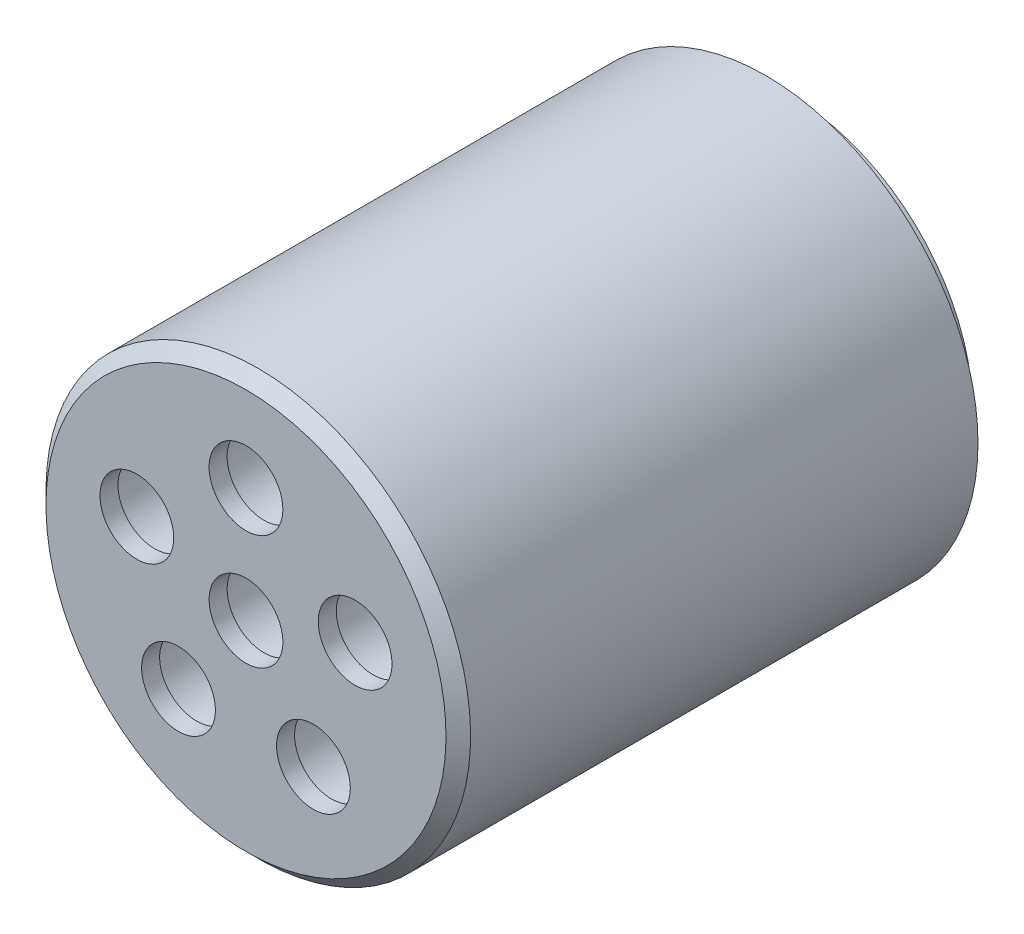
ISO-10303-21;
HEADER;
FILE_DESCRIPTION(('STEP AP214'),'2;1');
FILE_NAME('part.step','',(''),(''),'','','');
FILE_SCHEMA(('AUTOMOTIVE_DESIGN { 1 0 10303 214 1 1 1 1 }'));
ENDSEC;
DATA;
#1=APPLICATION_CONTEXT('core data for automotive mechanical design processes');
#2=APPLICATION_PROTOCOL_DEFINITION('international standard','automotive_design',2000,#1);
#3=PRODUCT_CONTEXT('',#1,'mechanical');
#4=PRODUCT('Part','Part','',(#3));
#5=PRODUCT_RELATED_PRODUCT_CATEGORY('part','',(#4));
#6=PRODUCT_DEFINITION_FORMATION('','',#4);
#7=PRODUCT_DEFINITION_CONTEXT('part definition',#1,'design');
#8=PRODUCT_DEFINITION('design','',#6,#7);
#9=PRODUCT_DEFINITION_SHAPE('','',#8);
#10=(LENGTH_UNIT() NAMED_UNIT(*) SI_UNIT(.MILLI.,.METRE.));
#11=(NAMED_UNIT(*) PLANE_ANGLE_UNIT() SI_UNIT($,.RADIAN.));
#12=(NAMED_UNIT(*) SI_UNIT($,.STERADIAN.) SOLID_ANGLE_UNIT());
#13=UNCERTAINTY_MEASURE_WITH_UNIT(LENGTH_MEASURE(1.E-05),#10,'distance_accuracy_value','');
#14=(GEOMETRIC_REPRESENTATION_CONTEXT(3) GLOBAL_UNCERTAINTY_ASSIGNED_CONTEXT((#13)) GLOBAL_UNIT_ASSIGNED_CONTEXT((#10,
#11,#12)) REPRESENTATION_CONTEXT('',''));
#15=CARTESIAN_POINT('',(0.,0.,0.));
#16=DIRECTION('',(0.,0.,1.));
#17=DIRECTION('',(1.,0.,0.));
#18=AXIS2_PLACEMENT_3D('',#15,#16,#17);
#19=CARTESIAN_POINT('',(3.38195697194555,1.09886443199731,11.7983020948289));
#20=DIRECTION('',(0.,0.,1.));
#21=DIRECTION('',(0.,-1.,0.));
#22=AXIS2_PLACEMENT_3D('',#19,#20,#21);
#23=CYLINDRICAL_SURFACE('',#22,1.5113);
#24=CARTESIAN_POINT('',(3.38195697194555,1.09886443199731,19.9644044732656));
#25=DIRECTION('',(0.,0.,1.));
#26=DIRECTION('',(0.,-1.,0.));
#27=AXIS2_PLACEMENT_3D('',#24,#25,#26);
#28=CIRCLE('',#27,1.5113);
#29=CARTESIAN_POINT('',(3.38195697194555,-0.412435568002688,19.9644044732656));
#30=VERTEX_POINT('',#29);
#31=EDGE_CURVE('E19',#30,#30,#28,.T.);
#32=ORIENTED_EDGE('',*,*,#31,.T.);
#33=EDGE_LOOP('',(#32));
#34=FACE_BOUND('',#33,.T.);
#35=CARTESIAN_POINT('',(3.38195697194555,1.09886443199731,3.63219875470677));
#36=DIRECTION('',(0.,-8.75136113852796E-07,-0.999999999999617));
#37=DIRECTION('',(0.,0.999999999999617,-8.75136113852796E-07));
#38=AXIS2_PLACEMENT_3D('',#35,#36,#37);
#39=CIRCLE('',#38,1.5113);
#40=CARTESIAN_POINT('',(3.38195697194555,2.61016443199673,3.63219743211356));
#41=VERTEX_POINT('',#40);
#42=EDGE_CURVE('E83',#41,#41,#39,.F.);
#43=ORIENTED_EDGE('',*,*,#42,.F.);
#44=EDGE_LOOP('',(#43));
#45=FACE_BOUND('',#44,.T.);
#46=ADVANCED_FACE('F16',(#34,#45),#23,.F.);
#47=CARTESIAN_POINT('',(2.09016435715203,-2.87686443199732,11.7983020948289));
#48=DIRECTION('',(0.,0.,1.));
#49=DIRECTION('',(1.,0.,0.));
#50=AXIS2_PLACEMENT_3D('',#47,#48,#49);
#51=CYLINDRICAL_SURFACE('',#50,1.5113);
#52=CARTESIAN_POINT('',(2.09016435715203,-2.87686443199732,19.9644044732656));
#53=DIRECTION('',(0.,0.,1.));
#54=DIRECTION('',(1.,0.,0.));
#55=AXIS2_PLACEMENT_3D('',#52,#53,#54);
#56=CIRCLE('',#55,1.5113);
#57=CARTESIAN_POINT('',(3.60146435715203,-2.87686443199732,19.9644044732656));
#58=VERTEX_POINT('',#57);
#59=EDGE_CURVE('E97',#58,#58,#56,.T.);
#60=ORIENTED_EDGE('',*,*,#59,.T.);
#61=EDGE_LOOP('',(#60));
#62=FACE_BOUND('',#61,.T.);
#63=CARTESIAN_POINT('',(2.09016435715203,-2.87686443199732,3.63220223401068));
#64=DIRECTION('',(0.,-8.75136113852796E-07,-0.999999999999617));
#65=DIRECTION('',(0.,0.999999999999617,-8.75136113852796E-07));
#66=AXIS2_PLACEMENT_3D('',#63,#64,#65);
#67=CIRCLE('',#66,1.5113);
#68=CARTESIAN_POINT('',(2.09016435715203,-1.3655644319979,3.63220091141747));
#69=VERTEX_POINT('',#68);
#70=EDGE_CURVE('E80',#69,#69,#67,.F.);
#71=ORIENTED_EDGE('',*,*,#70,.F.);
#72=EDGE_LOOP('',(#71));
#73=FACE_BOUND('',#72,.T.);
#74=ADVANCED_FACE('F196',(#62,#73),#51,.F.);
#75=CARTESIAN_POINT('',(-2.09016435715203,-2.87686443199732,11.7983020948289));
#76=DIRECTION('',(0.,0.,1.));
#77=DIRECTION('',(1.,0.,0.));
#78=AXIS2_PLACEMENT_3D('',#75,#76,#77);
#79=CYLINDRICAL_SURFACE('',#78,1.5113);
#80=CARTESIAN_POINT('',(-2.09016435715203,-2.87686443199732,19.9644044732656));
#81=DIRECTION('',(0.,0.,1.));
#82=DIRECTION('',(1.,0.,0.));
#83=AXIS2_PLACEMENT_3D('',#80,#81,#82);
#84=CIRCLE('',#83,1.5113);
#85=CARTESIAN_POINT('',(-0.578864357152034,-2.87686443199732,19.9644044732656));
#86=VERTEX_POINT('',#85);
#87=EDGE_CURVE('E95',#86,#86,#84,.T.);
#88=ORIENTED_EDGE('',*,*,#87,.T.);
#89=EDGE_LOOP('',(#88));
#90=FACE_BOUND('',#89,.T.);
#91=CARTESIAN_POINT('',(-2.09016435715203,-2.87686443199732,3.63220223401068));
#92=DIRECTION('',(0.,-8.75136113852796E-07,-0.999999999999617));
#93=DIRECTION('',(0.,0.999999999999617,-8.75136113852796E-07));
#94=AXIS2_PLACEMENT_3D('',#91,#92,#93);
#95=CIRCLE('',#94,1.5113);
#96=CARTESIAN_POINT('',(-2.09016435715203,-1.3655644319979,3.63220091141747));
#97=VERTEX_POINT('',#96);
#98=EDGE_CURVE('E77',#97,#97,#95,.F.);
#99=ORIENTED_EDGE('',*,*,#98,.F.);
#100=EDGE_LOOP('',(#99));
#101=FACE_BOUND('',#100,.T.);
#102=ADVANCED_FACE('F192',(#90,#101),#79,.F.);
#103=CARTESIAN_POINT('',(-3.38195697194555,1.09886443199731,11.7983020948289));
#104=DIRECTION('',(0.,0.,1.));
#105=DIRECTION('',(0.,-1.,0.));
#106=AXIS2_PLACEMENT_3D('',#103,#104,#105);
#107=CYLINDRICAL_SURFACE('',#106,1.5113);
#108=CARTESIAN_POINT('',(-3.38195697194555,1.09886443199731,19.9644044732656));
#109=DIRECTION('',(0.,0.,1.));
#110=DIRECTION('',(0.,-1.,0.));
#111=AXIS2_PLACEMENT_3D('',#108,#109,#110);
#112=CIRCLE('',#111,1.5113);
#113=CARTESIAN_POINT('',(-3.38195697194555,-0.412435568002688,19.9644044732656));
#114=VERTEX_POINT('',#113);
#115=EDGE_CURVE('E92',#114,#114,#112,.T.);
#116=ORIENTED_EDGE('',*,*,#115,.T.);
#117=EDGE_LOOP('',(#116));
#118=FACE_BOUND('',#117,.T.);
#119=CARTESIAN_POINT('',(-3.38195697194555,1.09886443199731,3.63219875470677));
#120=DIRECTION('',(0.,-8.75136113852796E-07,-0.999999999999617));
#121=DIRECTION('',(0.,0.999999999999617,-8.75136113852796E-07));
#122=AXIS2_PLACEMENT_3D('',#119,#120,#121);
#123=CIRCLE('',#122,1.5113);
#124=CARTESIAN_POINT('',(-3.38195697194555,2.61016443199673,3.63219743211356));
#125=VERTEX_POINT('',#124);
#126=EDGE_CURVE('E74',#125,#125,#123,.F.);
#127=ORIENTED_EDGE('',*,*,#126,.F.);
#128=EDGE_LOOP('',(#127));
#129=FACE_BOUND('',#128,.T.);
#130=ADVANCED_FACE('F195',(#118,#129),#107,.F.);
#131=CARTESIAN_POINT('',(0.,3.556,11.7983020948289));
#132=DIRECTION('',(0.,0.,1.));
#133=DIRECTION('',(1.,0.,0.));
#134=AXIS2_PLACEMENT_3D('',#131,#132,#133);
#135=CYLINDRICAL_SURFACE('',#134,1.5113);
#136=CARTESIAN_POINT('',(0.,3.556,19.9644044732656));
#137=DIRECTION('',(0.,0.,1.));
#138=DIRECTION('',(1.,0.,0.));
#139=AXIS2_PLACEMENT_3D('',#136,#137,#138);
#140=CIRCLE('',#139,1.5113);
#141=CARTESIAN_POINT('',(1.5113,3.556,19.9644044732656));
#142=VERTEX_POINT('',#141);
#143=EDGE_CURVE('E89',#142,#142,#140,.T.);
#144=ORIENTED_EDGE('',*,*,#143,.T.);
#145=EDGE_LOOP('',(#144));
#146=FACE_BOUND('',#145,.T.);
#147=CARTESIAN_POINT('',(0.,3.556,3.6321966043787));
#148=DIRECTION('',(0.,-8.75136113852796E-07,-0.999999999999617));
#149=DIRECTION('',(0.,0.999999999999617,-8.75136113852796E-07));
#150=AXIS2_PLACEMENT_3D('',#147,#148,#149);
#151=CIRCLE('',#150,1.5113);
#152=CARTESIAN_POINT('',(0.,5.06729999999942,3.63219528178549));
#153=VERTEX_POINT('',#152);
#154=EDGE_CURVE('E71',#153,#153,#151,.F.);
#155=ORIENTED_EDGE('',*,*,#154,.F.);
#156=EDGE_LOOP('',(#155));
#157=FACE_BOUND('',#156,.T.);
#158=ADVANCED_FACE('F120',(#146,#157),#135,.F.);
#159=CARTESIAN_POINT('',(0.,0.,11.7983020948289));
#160=DIRECTION('',(0.,0.,-1.));
#161=DIRECTION('',(-1.,0.,0.));
#162=AXIS2_PLACEMENT_3D('',#159,#160,#161);
#163=CYLINDRICAL_SURFACE('',#162,1.5113);
#164=CARTESIAN_POINT('',(0.,0.,3.63219971636272));
#165=DIRECTION('',(0.,-8.75136113852796E-07,-0.999999999999617));
#166=DIRECTION('',(0.,0.999999999999617,-8.75136113852796E-07));
#167=AXIS2_PLACEMENT_3D('',#164,#165,#166);
#168=CIRCLE('',#167,1.5113);
#169=CARTESIAN_POINT('',(0.,1.51129999999942,3.63219839376951));
#170=VERTEX_POINT('',#169);
#171=EDGE_CURVE('E68',#170,#170,#168,.F.);
#172=ORIENTED_EDGE('',*,*,#171,.F.);
#173=EDGE_LOOP('',(#172));
#174=FACE_BOUND('',#173,.T.);
#175=CARTESIAN_POINT('',(0.,0.,19.9644044732656));
#176=DIRECTION('',(0.,0.,-1.));
#177=DIRECTION('',(-1.,0.,0.));
#178=AXIS2_PLACEMENT_3D('',#175,#176,#177);
#179=CIRCLE('',#178,1.5113);
#180=CARTESIAN_POINT('',(-1.5113,0.,19.9644044732656));
#181=VERTEX_POINT('',#180);
#182=EDGE_CURVE('E86',#181,#181,#179,.F.);
#183=ORIENTED_EDGE('',*,*,#182,.T.);
#184=EDGE_LOOP('',(#183));
#185=FACE_BOUND('',#184,.T.);
#186=ADVANCED_FACE('F109',(#174,#185),#163,.F.);
#187=CARTESIAN_POINT('',(2.29489983891079,0.74565815854384,19.9644044732656));
#188=DIRECTION('',(0.,0.,1.));
#189=DIRECTION('',(0.,-1.,0.));
#190=AXIS2_PLACEMENT_3D('',#187,#188,#189);
#191=PLANE('',#190);
#192=CARTESIAN_POINT('',(3.38195697194555,1.09886443199731,19.9644044732656));
#193=DIRECTION('',(0.,0.,1.));
#194=DIRECTION('',(0.,-1.,0.));
#195=AXIS2_PLACEMENT_3D('',#192,#193,#194);
#196=CIRCLE('',#195,1.14299975548785);
#197=CARTESIAN_POINT('',(3.38195697194555,-0.0441353234905354,19.9644044732656));
#198=VERTEX_POINT('',#197);
#199=EDGE_CURVE('E65',#198,#198,#196,.T.);
#200=ORIENTED_EDGE('',*,*,#199,.T.);
#201=EDGE_LOOP('',(#200));
#202=FACE_BOUND('',#201,.T.);
#203=ORIENTED_EDGE('',*,*,#31,.F.);
#204=EDGE_LOOP('',(#203));
#205=FACE_BOUND('',#204,.T.);
#206=ADVANCED_FACE('F106',(#202,#205),#191,.F.);
#207=CARTESIAN_POINT('',(1.41832610122353,-1.95215840305643,19.9644044732656));
#208=DIRECTION('',(0.,0.,1.));
#209=DIRECTION('',(1.,0.,0.));
#210=AXIS2_PLACEMENT_3D('',#207,#208,#209);
#211=PLANE('',#210);
#212=CARTESIAN_POINT('',(2.09016435715203,-2.87686443199732,19.9644044732656));
#213=DIRECTION('',(0.,0.,1.));
#214=DIRECTION('',(1.,0.,0.));
#215=AXIS2_PLACEMENT_3D('',#212,#213,#214);
#216=CIRCLE('',#215,1.14299975548785);
#217=CARTESIAN_POINT('',(3.23316411263988,-2.87686443199732,19.9644044732656));
#218=VERTEX_POINT('',#217);
#219=EDGE_CURVE('E62',#218,#218,#216,.T.);
#220=ORIENTED_EDGE('',*,*,#219,.T.);
#221=EDGE_LOOP('',(#220));
#222=FACE_BOUND('',#221,.T.);
#223=ORIENTED_EDGE('',*,*,#59,.F.);
#224=EDGE_LOOP('',(#223));
#225=FACE_BOUND('',#224,.T.);
#226=ADVANCED_FACE('F108',(#222,#225),#211,.F.);
#227=CARTESIAN_POINT('',(-1.41832610122353,-1.95215840305643,19.9644044732656));
#228=DIRECTION('',(0.,0.,1.));
#229=DIRECTION('',(1.,0.,0.));
#230=AXIS2_PLACEMENT_3D('',#227,#228,#229);
#231=PLANE('',#230);
#232=CARTESIAN_POINT('',(-2.09016435715203,-2.87686443199732,19.9644044732656));
#233=DIRECTION('',(0.,0.,1.));
#234=DIRECTION('',(1.,0.,0.));
#235=AXIS2_PLACEMENT_3D('',#232,#233,#234);
#236=CIRCLE('',#235,1.14299975548785);
#237=CARTESIAN_POINT('',(-0.947164601664186,-2.87686443199732,19.9644044732656));
#238=VERTEX_POINT('',#237);
#239=EDGE_CURVE('E59',#238,#238,#236,.T.);
#240=ORIENTED_EDGE('',*,*,#239,.T.);
#241=EDGE_LOOP('',(#240));
#242=FACE_BOUND('',#241,.T.);
#243=ORIENTED_EDGE('',*,*,#87,.F.);
#244=EDGE_LOOP('',(#243));
#245=FACE_BOUND('',#244,.T.);
#246=ADVANCED_FACE('F117',(#242,#245),#231,.F.);
#247=CARTESIAN_POINT('',(-2.29489983891079,0.74565815854384,19.9644044732656));
#248=DIRECTION('',(0.,0.,1.));
#249=DIRECTION('',(0.,-1.,0.));
#250=AXIS2_PLACEMENT_3D('',#247,#248,#249);
#251=PLANE('',#250);
#252=CARTESIAN_POINT('',(-3.38195697194555,1.09886443199731,19.9644044732656));
#253=DIRECTION('',(0.,0.,1.));
#254=DIRECTION('',(0.,-1.,0.));
#255=AXIS2_PLACEMENT_3D('',#252,#253,#254);
#256=CIRCLE('',#255,1.14299975548785);
#257=CARTESIAN_POINT('',(-3.38195697194555,-0.0441353234905354,19.9644044732656));
#258=VERTEX_POINT('',#257);
#259=EDGE_CURVE('E56',#258,#258,#256,.T.);
#260=ORIENTED_EDGE('',*,*,#259,.T.);
#261=EDGE_LOOP('',(#260));
#262=FACE_BOUND('',#261,.T.);
#263=ORIENTED_EDGE('',*,*,#115,.F.);
#264=EDGE_LOOP('',(#263));
#265=FACE_BOUND('',#264,.T.);
#266=ADVANCED_FACE('F179',(#262,#265),#251,.F.);
#267=CARTESIAN_POINT('',(0.,2.41300048902518,19.9644044732656));
#268=DIRECTION('',(0.,0.,1.));
#269=DIRECTION('',(1.,0.,0.));
#270=AXIS2_PLACEMENT_3D('',#267,#268,#269);
#271=PLANE('',#270);
#272=CARTESIAN_POINT('',(0.,3.556,19.9644044732656));
#273=DIRECTION('',(0.,0.,1.));
#274=DIRECTION('',(1.,0.,0.));
#275=AXIS2_PLACEMENT_3D('',#272,#273,#274);
#276=CIRCLE('',#275,1.14299975548785);
#277=CARTESIAN_POINT('',(1.14299975548785,3.556,19.9644044732656));
#278=VERTEX_POINT('',#277);
#279=EDGE_CURVE('E53',#278,#278,#276,.T.);
#280=ORIENTED_EDGE('',*,*,#279,.T.);
#281=EDGE_LOOP('',(#280));
#282=FACE_BOUND('',#281,.T.);
#283=ORIENTED_EDGE('',*,*,#143,.F.);
#284=EDGE_LOOP('',(#283));
#285=FACE_BOUND('',#284,.T.);
#286=ADVANCED_FACE('F175',(#282,#285),#271,.F.);
#287=CARTESIAN_POINT('',(0.,1.5113,19.9644044732656));
#288=DIRECTION('',(0.,0.,1.));
#289=DIRECTION('',(1.,0.,0.));
#290=AXIS2_PLACEMENT_3D('',#287,#288,#289);
#291=PLANE('',#290);
#292=CARTESIAN_POINT('',(0.,0.,19.9644044732656));
#293=DIRECTION('',(0.,0.,-1.));
#294=DIRECTION('',(-1.,0.,0.));
#295=AXIS2_PLACEMENT_3D('',#292,#293,#294);
#296=CIRCLE('',#295,1.14299975548784);
#297=CARTESIAN_POINT('',(-1.14299975548784,0.,19.9644044732656));
#298=VERTEX_POINT('',#297);
#299=EDGE_CURVE('E50',#298,#298,#296,.F.);
#300=ORIENTED_EDGE('',*,*,#299,.T.);
#301=EDGE_LOOP('',(#300));
#302=FACE_BOUND('',#301,.T.);
#303=ORIENTED_EDGE('',*,*,#182,.F.);
#304=EDGE_LOOP('',(#303));
#305=FACE_BOUND('',#304,.T.);
#306=ADVANCED_FACE('F171',(#302,#305),#291,.F.);
#307=CARTESIAN_POINT('',(0.,0.,3.63219971636272));
#308=DIRECTION('',(0.,-8.75136113852796E-07,-0.999999999999617));
#309=DIRECTION('',(0.,0.999999999999617,-8.75136113852796E-07));
#310=AXIS2_PLACEMENT_3D('',#307,#308,#309);
#311=PLANE('',#310);
#312=ORIENTED_EDGE('',*,*,#171,.T.);
#313=EDGE_LOOP('',(#312));
#314=FACE_BOUND('',#313,.T.);
#315=ORIENTED_EDGE('',*,*,#154,.T.);
#316=EDGE_LOOP('',(#315));
#317=FACE_BOUND('',#316,.T.);
#318=ORIENTED_EDGE('',*,*,#126,.T.);
#319=EDGE_LOOP('',(#318));
#320=FACE_BOUND('',#319,.T.);
#321=ORIENTED_EDGE('',*,*,#98,.T.);
#322=EDGE_LOOP('',(#321));
#323=FACE_BOUND('',#322,.T.);
#324=ORIENTED_EDGE('',*,*,#70,.T.);
#325=EDGE_LOOP('',(#324));
#326=FACE_BOUND('',#325,.T.);
#327=ORIENTED_EDGE('',*,*,#42,.T.);
#328=EDGE_LOOP('',(#327));
#329=FACE_BOUND('',#328,.T.);
#330=CARTESIAN_POINT('',(0.,0.,3.63219971636272));
#331=DIRECTION('',(0.,-8.75136113852796E-07,-0.999999999999617));
#332=DIRECTION('',(0.,0.999999999999617,-8.75136113852796E-07));
#333=AXIS2_PLACEMENT_3D('',#330,#331,#332);
#334=CIRCLE('',#333,5.62611520794538);
#335=CARTESIAN_POINT('',(0.,5.62611520794322,3.63219479274612));
#336=VERTEX_POINT('',#335);
#337=EDGE_CURVE('E37',#336,#336,#334,.F.);
#338=ORIENTED_EDGE('',*,*,#337,.F.);
#339=EDGE_LOOP('',(#338));
#340=FACE_BOUND('',#339,.T.);
#341=ADVANCED_FACE('F168',(#314,#317,#320,#323,#326,#329,#340),#311,.T.);
#342=CARTESIAN_POINT('',(3.38195697194555,1.09886443199731,20.2438044732656));
#343=DIRECTION('',(0.,0.,1.));
#344=DIRECTION('',(0.,-1.,0.));
#345=AXIS2_PLACEMENT_3D('',#342,#343,#344);
#346=CYLINDRICAL_SURFACE('',#345,1.14299975548785);
#347=CARTESIAN_POINT('',(3.38195697194555,1.09886443199731,20.5232045118902));
#348=DIRECTION('',(0.,8.75136113852796E-07,0.999999999999617));
#349=DIRECTION('',(0.,-0.999999999999617,8.75136113852796E-07));
#350=AXIS2_PLACEMENT_3D('',#347,#348,#349);
#351=CIRCLE('',#350,1.14299975548785);
#352=CARTESIAN_POINT('',(4.4690143375263,1.45207078100858,20.5232043380261));
#353=VERTEX_POINT('',#352);
#354=CARTESIAN_POINT('',(2.29489960636507,0.745658082985155,20.5232044732656));
#355=VERTEX_POINT('',#354);
#356=EDGE_CURVE('E31',#353,#355,#351,.F.);
#357=ORIENTED_EDGE('',*,*,#356,.F.);
#358=CARTESIAN_POINT('',(3.38195697194555,1.09886443199731,20.5232044732656));
#359=DIRECTION('',(0.,0.,1.));
#360=DIRECTION('',(0.,-1.,0.));
#361=AXIS2_PLACEMENT_3D('',#358,#359,#360);
#362=CIRCLE('',#361,1.14299975548785);
#363=EDGE_CURVE('E33',#355,#353,#362,.F.);
#364=ORIENTED_EDGE('',*,*,#363,.F.);
#365=EDGE_LOOP('',(#357,#364));
#366=FACE_BOUND('',#365,.T.);
#367=ORIENTED_EDGE('',*,*,#199,.F.);
#368=EDGE_LOOP('',(#367));
#369=FACE_BOUND('',#368,.T.);
#370=ADVANCED_FACE('F34',(#366,#369),#346,.F.);
#371=CARTESIAN_POINT('',(2.09016435715203,-2.87686443199732,20.2438044732656));
#372=DIRECTION('',(0.,0.,1.));
#373=DIRECTION('',(1.,0.,0.));
#374=AXIS2_PLACEMENT_3D('',#371,#372,#373);
#375=CYLINDRICAL_SURFACE('',#374,1.14299975548785);
#376=CARTESIAN_POINT('',(2.09016435715203,-2.87686443199732,20.5232079911942));
#377=DIRECTION('',(0.,8.75136113852796E-07,0.999999999999617));
#378=DIRECTION('',(0.,-0.999999999999617,8.75136113852796E-07));
#379=AXIS2_PLACEMENT_3D('',#376,#377,#378);
#380=CIRCLE('',#379,1.14299975548785);
#381=CARTESIAN_POINT('',(2.09016435715203,-4.01986418748473,20.5232089914745));
#382=VERTEX_POINT('',#381);
#383=EDGE_CURVE('E41',#382,#382,#380,.F.);
#384=ORIENTED_EDGE('',*,*,#383,.F.);
#385=EDGE_LOOP('',(#384));
#386=FACE_BOUND('',#385,.T.);
#387=ORIENTED_EDGE('',*,*,#219,.F.);
#388=EDGE_LOOP('',(#387));
#389=FACE_BOUND('',#388,.T.);
#390=ADVANCED_FACE('F161',(#386,#389),#375,.F.);
#391=CARTESIAN_POINT('',(-2.09016435715203,-2.87686443199732,20.2438044732656));
#392=DIRECTION('',(0.,0.,1.));
#393=DIRECTION('',(1.,0.,0.));
#394=AXIS2_PLACEMENT_3D('',#391,#392,#393);
#395=CYLINDRICAL_SURFACE('',#394,1.14299975548785);
#396=CARTESIAN_POINT('',(-2.09016435715203,-2.87686443199732,20.5232079911942));
#397=DIRECTION('',(0.,8.75136113852796E-07,0.999999999999617));
#398=DIRECTION('',(0.,-0.999999999999617,8.75136113852796E-07));
#399=AXIS2_PLACEMENT_3D('',#396,#397,#398);
#400=CIRCLE('',#399,1.14299975548785);
#401=CARTESIAN_POINT('',(-2.09016435715203,-4.01986418748473,20.5232089914745));
#402=VERTEX_POINT('',#401);
#403=EDGE_CURVE('E44',#402,#402,#400,.F.);
#404=ORIENTED_EDGE('',*,*,#403,.F.);
#405=EDGE_LOOP('',(#404));
#406=FACE_BOUND('',#405,.T.);
#407=ORIENTED_EDGE('',*,*,#239,.F.);
#408=EDGE_LOOP('',(#407));
#409=FACE_BOUND('',#408,.T.);
#410=ADVANCED_FACE('F157',(#406,#409),#395,.F.);
#411=CARTESIAN_POINT('',(-3.38195697194555,1.09886443199731,20.2438044732656));
#412=DIRECTION('',(0.,0.,1.));
#413=DIRECTION('',(0.,-1.,0.));
#414=AXIS2_PLACEMENT_3D('',#411,#412,#413);
#415=CYLINDRICAL_SURFACE('',#414,1.14299975548785);
#416=CARTESIAN_POINT('',(-3.38195697194555,1.09886443199731,20.5232045118902));
#417=DIRECTION('',(0.,8.75136113852796E-07,0.999999999999617));
#418=DIRECTION('',(0.,-0.999999999999617,8.75136113852796E-07));
#419=AXIS2_PLACEMENT_3D('',#416,#417,#418);
#420=CIRCLE('',#419,1.14299975548785);
#421=CARTESIAN_POINT('',(-3.38195697194555,-0.0441353234900978,20.5232055121706));
#422=VERTEX_POINT('',#421);
#423=EDGE_CURVE('E222',#422,#422,#420,.F.);
#424=ORIENTED_EDGE('',*,*,#423,.F.);
#425=EDGE_LOOP('',(#424));
#426=FACE_BOUND('',#425,.T.);
#427=ORIENTED_EDGE('',*,*,#259,.F.);
#428=EDGE_LOOP('',(#427));
#429=FACE_BOUND('',#428,.T.);
#430=ADVANCED_FACE('F153',(#426,#429),#415,.F.);
#431=CARTESIAN_POINT('',(0.,3.556,20.2438044732656));
#432=DIRECTION('',(0.,0.,1.));
#433=DIRECTION('',(1.,0.,0.));
#434=AXIS2_PLACEMENT_3D('',#431,#432,#433);
#435=CYLINDRICAL_SURFACE('',#434,1.14299975548785);
#436=CARTESIAN_POINT('',(0.,3.556,20.5232023615622));
#437=DIRECTION('',(0.,8.75136113852796E-07,0.999999999999617));
#438=DIRECTION('',(0.,-0.999999999999617,8.75136113852796E-07));
#439=AXIS2_PLACEMENT_3D('',#436,#437,#438);
#440=CIRCLE('',#439,1.14299975548785);
#441=CARTESIAN_POINT('',(0.,2.41300024451259,20.5232033618425));
#442=VERTEX_POINT('',#441);
#443=EDGE_CURVE('E216',#442,#442,#440,.F.);
#444=ORIENTED_EDGE('',*,*,#443,.F.);
#445=EDGE_LOOP('',(#444));
#446=FACE_BOUND('',#445,.T.);
#447=ORIENTED_EDGE('',*,*,#279,.F.);
#448=EDGE_LOOP('',(#447));
#449=FACE_BOUND('',#448,.T.);
#450=ADVANCED_FACE('F149',(#446,#449),#435,.F.);
#451=CARTESIAN_POINT('',(0.,0.,20.2438044732656));
#452=DIRECTION('',(0.,0.,-1.));
#453=DIRECTION('',(-1.,0.,0.));
#454=AXIS2_PLACEMENT_3D('',#451,#452,#453);
#455=CYLINDRICAL_SURFACE('',#454,1.14299975548784);
#456=ORIENTED_EDGE('',*,*,#299,.F.);
#457=EDGE_LOOP('',(#456));
#458=FACE_BOUND('',#457,.T.);
#459=CARTESIAN_POINT('',(0.,0.,20.5232054735462));
#460=DIRECTION('',(0.,8.75136113852796E-07,0.999999999999617));
#461=DIRECTION('',(0.,-0.999999999999617,8.75136113852796E-07));
#462=AXIS2_PLACEMENT_3D('',#459,#460,#461);
#463=CIRCLE('',#462,1.14299975548784);
#464=CARTESIAN_POINT('',(0.,-1.14299975548741,20.5232064738266));
#465=VERTEX_POINT('',#464);
#466=EDGE_CURVE('E211',#465,#465,#463,.F.);
#467=ORIENTED_EDGE('',*,*,#466,.F.);
#468=EDGE_LOOP('',(#467));
#469=FACE_BOUND('',#468,.T.);
#470=ADVANCED_FACE('F145',(#458,#469),#455,.F.);
#471=CARTESIAN_POINT('',(0.,0.,3.30200221403677));
#472=DIRECTION('',(0.,0.,-1.));
#473=DIRECTION('',(-1.,0.,0.));
#474=AXIS2_PLACEMENT_3D('',#471,#472,#473);
#475=CYLINDRICAL_SURFACE('',#474,5.62611520794538);
#476=ORIENTED_EDGE('',*,*,#337,.T.);
#477=EDGE_LOOP('',(#476));
#478=FACE_BOUND('',#477,.T.);
#479=CARTESIAN_POINT('',(0.,0.,4.41960221403677));
#480=DIRECTION('',(0.,0.,-1.));
#481=DIRECTION('',(-1.,0.,0.));
#482=AXIS2_PLACEMENT_3D('',#479,#480,#481);
#483=CIRCLE('',#482,5.62611520794538);
#484=CARTESIAN_POINT('',(-5.62611520794538,0.,4.41960221403677));
#485=VERTEX_POINT('',#484);
#486=EDGE_CURVE('E209',#485,#485,#483,.T.);
#487=ORIENTED_EDGE('',*,*,#486,.T.);
#488=EDGE_LOOP('',(#487));
#489=FACE_BOUND('',#488,.T.);
#490=ADVANCED_FACE('F141',(#478,#489),#475,.T.);
#491=CARTESIAN_POINT('',(0.,6.57861489307085,20.5231997163627));
#492=DIRECTION('',(0.,8.75136113852796E-07,0.999999999999617));
#493=DIRECTION('',(0.,-0.999999999999617,8.75136113852796E-07));
#494=AXIS2_PLACEMENT_3D('',#491,#492,#493);
#495=PLANE('',#494);
#496=ORIENTED_EDGE('',*,*,#466,.T.);
#497=EDGE_LOOP('',(#496));
#498=FACE_BOUND('',#497,.T.);
#499=ORIENTED_EDGE('',*,*,#443,.T.);
#500=EDGE_LOOP('',(#499));
#501=FACE_BOUND('',#500,.T.);
#502=ORIENTED_EDGE('',*,*,#423,.T.);
#503=EDGE_LOOP('',(#502));
#504=FACE_BOUND('',#503,.T.);
#505=ORIENTED_EDGE('',*,*,#403,.T.);
#506=EDGE_LOOP('',(#505));
#507=FACE_BOUND('',#506,.T.);
#508=ORIENTED_EDGE('',*,*,#383,.T.);
#509=EDGE_LOOP('',(#508));
#510=FACE_BOUND('',#509,.T.);
#511=ORIENTED_EDGE('',*,*,#363,.T.);
#512=ORIENTED_EDGE('',*,*,#356,.T.);
#513=EDGE_LOOP('',(#511,#512));
#514=FACE_BOUND('',#513,.T.);
#515=CARTESIAN_POINT('',(0.,1.47819291416098E-05,20.5232054734063));
#516=DIRECTION('',(0.,-8.75136114695908E-07,-0.999999999999617));
#517=DIRECTION('',(0.,0.999999999999617,-8.75136114695908E-07));
#518=AXIS2_PLACEMENT_3D('',#515,#516,#517);
#519=CIRCLE('',#518,6.19760011130903);
#520=CARTESIAN_POINT('',(0.,6.1976148932358,20.5232000496626));
#521=VERTEX_POINT('',#520);
#522=EDGE_CURVE('E210',#521,#521,#519,.T.);
#523=ORIENTED_EDGE('',*,*,#522,.F.);
#524=EDGE_LOOP('',(#523));
#525=FACE_BOUND('',#524,.T.);
#526=ADVANCED_FACE('F39',(#498,#501,#504,#507,#510,#514,#525),#495,.T.);
#527=CARTESIAN_POINT('',(0.,6.57861520794538,4.41960221403677));
#528=DIRECTION('',(0.,0.,1.));
#529=DIRECTION('',(1.,0.,0.));
#530=AXIS2_PLACEMENT_3D('',#527,#528,#529);
#531=PLANE('',#530);
#532=ORIENTED_EDGE('',*,*,#486,.F.);
#533=EDGE_LOOP('',(#532));
#534=FACE_BOUND('',#533,.T.);
#535=CARTESIAN_POINT('',(0.,6.89084365956767E-07,4.41960221403677));
#536=DIRECTION('',(0.,0.,1.));
#537=DIRECTION('',(1.,0.,0.));
#538=AXIS2_PLACEMENT_3D('',#535,#536,#537);
#539=CIRCLE('',#538,6.57860750210628);
#540=CARTESIAN_POINT('',(6.57860750210628,6.89084365956767E-07,4.41960221403677));
#541=VERTEX_POINT('',#540);
#542=EDGE_CURVE('E24',#541,#541,#539,.T.);
#543=ORIENTED_EDGE('',*,*,#542,.F.);
#544=EDGE_LOOP('',(#543));
#545=FACE_BOUND('',#544,.T.);
#546=ADVANCED_FACE('F131',(#534,#545),#531,.F.);
#547=CARTESIAN_POINT('',(0.,1.44485022821918E-05,20.1422054737276));
#548=DIRECTION('',(0.,-8.75136114695908E-07,-0.999999999999617));
#549=DIRECTION('',(0.,0.999999999999617,-8.75136114695908E-07));
#550=AXIS2_PLACEMENT_3D('',#547,#548,#549);
#551=CONICAL_SURFACE('',#550,6.57860750202329,0.785407862825019);
#552=ORIENTED_EDGE('',*,*,#522,.T.);
#553=EDGE_LOOP('',(#552));
#554=FACE_BOUND('',#553,.T.);
#555=CARTESIAN_POINT('',(0.,1.444850228219E-05,20.1422054736051));
#556=DIRECTION('',(0.,-8.75136113852796E-07,-0.999999999999617));
#557=DIRECTION('',(0.,0.999999999999617,-8.75136113852796E-07));
#558=AXIS2_PLACEMENT_3D('',#555,#556,#557);
#559=CIRCLE('',#558,6.57860750210628);
#560=CARTESIAN_POINT('',(0.,6.57862195060604,20.1421997164281));
#561=VERTEX_POINT('',#560);
#562=EDGE_CURVE('E11',#561,#561,#559,.T.);
#563=ORIENTED_EDGE('',*,*,#562,.F.);
#564=EDGE_LOOP('',(#563));
#565=FACE_BOUND('',#564,.T.);
#566=ADVANCED_FACE('F125',(#554,#565),#551,.T.);
#567=CARTESIAN_POINT('',(0.,7.3909670919771E-06,12.0777054735545));
#568=DIRECTION('',(0.,-8.75136113852796E-07,-0.999999999999617));
#569=DIRECTION('',(0.,0.999999999999617,-8.75136113852796E-07));
#570=AXIS2_PLACEMENT_3D('',#567,#568,#569);
#571=CYLINDRICAL_SURFACE('',#570,6.57860750210628);
#572=ORIENTED_EDGE('',*,*,#562,.T.);
#573=EDGE_LOOP('',(#572));
#574=FACE_BOUND('',#573,.T.);
#575=ORIENTED_EDGE('',*,*,#542,.T.);
#576=EDGE_LOOP('',(#575));
#577=FACE_BOUND('',#576,.T.);
#578=ADVANCED_FACE('F123',(#574,#577),#571,.T.);
#579=CLOSED_SHELL('',(#46,#74,#102,#130,#158,#186,#206,#226,#246,#266,#286,#306,#341,#370,#390,
#410,#430,#450,#470,#490,#526,#546,#566,#578));
#580=MANIFOLD_SOLID_BREP('B1',#579);
#581=ADVANCED_BREP_SHAPE_REPRESENTATION('',(#18,#580),#14);
#582=SHAPE_DEFINITION_REPRESENTATION(#9,#581);
ENDSEC;
END-ISO-10303-21;
